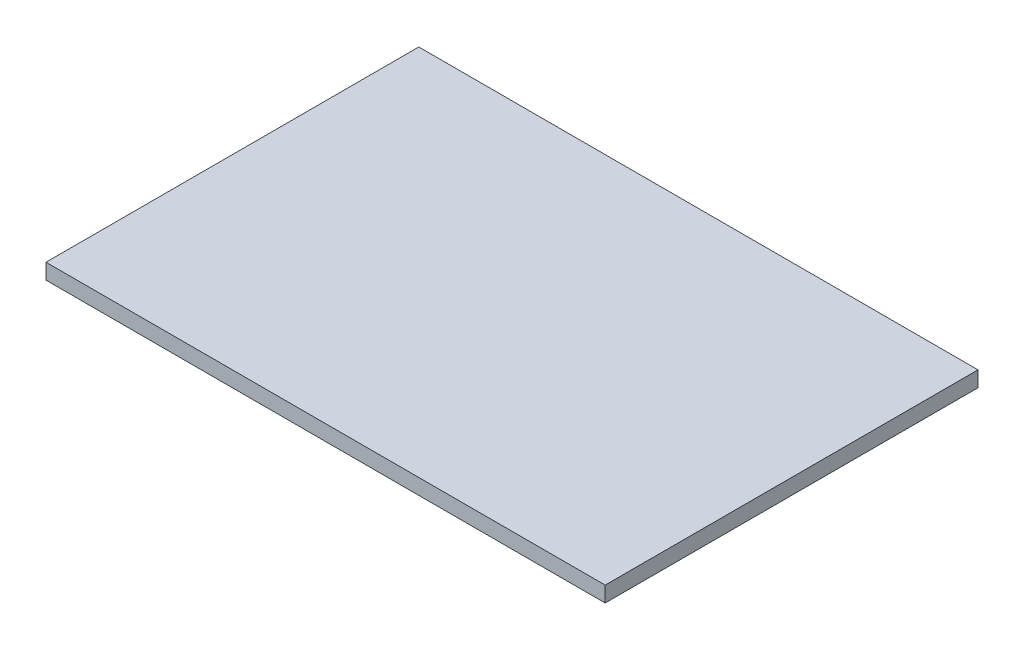
ISO-10303-21;
HEADER;
FILE_DESCRIPTION(('STEP AP214'),'2;1');
FILE_NAME('part.step','',(''),(''),'','','');
FILE_SCHEMA(('AUTOMOTIVE_DESIGN { 1 0 10303 214 1 1 1 1 }'));
ENDSEC;
DATA;
#1=APPLICATION_CONTEXT('core data for automotive mechanical design processes');
#2=APPLICATION_PROTOCOL_DEFINITION('international standard','automotive_design',2000,#1);
#3=PRODUCT_CONTEXT('',#1,'mechanical');
#4=PRODUCT('Part','Part','',(#3));
#5=PRODUCT_RELATED_PRODUCT_CATEGORY('part','',(#4));
#6=PRODUCT_DEFINITION_FORMATION('','',#4);
#7=PRODUCT_DEFINITION_CONTEXT('part definition',#1,'design');
#8=PRODUCT_DEFINITION('design','',#6,#7);
#9=PRODUCT_DEFINITION_SHAPE('','',#8);
#10=(LENGTH_UNIT() NAMED_UNIT(*) SI_UNIT(.MILLI.,.METRE.));
#11=(NAMED_UNIT(*) PLANE_ANGLE_UNIT() SI_UNIT($,.RADIAN.));
#12=(NAMED_UNIT(*) SI_UNIT($,.STERADIAN.) SOLID_ANGLE_UNIT());
#13=UNCERTAINTY_MEASURE_WITH_UNIT(LENGTH_MEASURE(1.E-05),#10,'distance_accuracy_value','');
#14=(GEOMETRIC_REPRESENTATION_CONTEXT(3) GLOBAL_UNCERTAINTY_ASSIGNED_CONTEXT((#13)) GLOBAL_UNIT_ASSIGNED_CONTEXT((#10,
#11,#12)) REPRESENTATION_CONTEXT('',''));
#15=CARTESIAN_POINT('',(0.,0.,0.));
#16=DIRECTION('',(0.,0.,1.));
#17=DIRECTION('',(1.,0.,0.));
#18=AXIS2_PLACEMENT_3D('',#15,#16,#17);
#19=CARTESIAN_POINT('',(90.,5.,60.));
#20=DIRECTION('',(-1.,0.,0.));
#21=DIRECTION('',(0.,0.,1.));
#22=AXIS2_PLACEMENT_3D('',#19,#20,#21);
#23=PLANE('',#22);
#24=DIRECTION('',(0.,0.,-1.));
#25=VECTOR('',#24,1.);
#26=CARTESIAN_POINT('',(90.,0.,60.));
#27=LINE('',#26,#25);
#28=CARTESIAN_POINT('',(90.,0.,60.));
#29=VERTEX_POINT('',#28);
#30=CARTESIAN_POINT('',(90.,0.,-60.));
#31=VERTEX_POINT('',#30);
#32=EDGE_CURVE('E98',#29,#31,#27,.T.);
#33=ORIENTED_EDGE('',*,*,#32,.T.);
#34=DIRECTION('',(0.,-1.,0.));
#35=VECTOR('',#34,1.);
#36=CARTESIAN_POINT('',(90.,5.,-60.));
#37=LINE('',#36,#35);
#38=CARTESIAN_POINT('',(90.,5.,-60.));
#39=VERTEX_POINT('',#38);
#40=EDGE_CURVE('E11',#39,#31,#37,.T.);
#41=ORIENTED_EDGE('',*,*,#40,.F.);
#42=DIRECTION('',(0.,0.,-1.));
#43=VECTOR('',#42,1.);
#44=CARTESIAN_POINT('',(90.,5.,60.));
#45=LINE('',#44,#43);
#46=CARTESIAN_POINT('',(90.,5.,60.));
#47=VERTEX_POINT('',#46);
#48=EDGE_CURVE('E86',#47,#39,#45,.T.);
#49=ORIENTED_EDGE('',*,*,#48,.F.);
#50=DIRECTION('',(0.,-1.,0.));
#51=VECTOR('',#50,1.);
#52=CARTESIAN_POINT('',(90.,5.,60.));
#53=LINE('',#52,#51);
#54=EDGE_CURVE('E94',#47,#29,#53,.T.);
#55=ORIENTED_EDGE('',*,*,#54,.T.);
#56=EDGE_LOOP('',(#33,#41,#49,#55));
#57=FACE_BOUND('',#56,.T.);
#58=ADVANCED_FACE('F35',(#57),#23,.F.);
#59=CARTESIAN_POINT('',(-90.,5.,-60.));
#60=DIRECTION('',(0.,0.,1.));
#61=DIRECTION('',(1.,0.,0.));
#62=AXIS2_PLACEMENT_3D('',#59,#60,#61);
#63=PLANE('',#62);
#64=DIRECTION('',(-1.,0.,0.));
#65=VECTOR('',#64,1.);
#66=CARTESIAN_POINT('',(-90.,0.,-60.));
#67=LINE('',#66,#65);
#68=CARTESIAN_POINT('',(-90.,0.,-60.));
#69=VERTEX_POINT('',#68);
#70=EDGE_CURVE('E90',#31,#69,#67,.T.);
#71=ORIENTED_EDGE('',*,*,#70,.T.);
#72=DIRECTION('',(0.,-1.,0.));
#73=VECTOR('',#72,1.);
#74=CARTESIAN_POINT('',(-90.,5.,-60.));
#75=LINE('',#74,#73);
#76=CARTESIAN_POINT('',(-90.,5.,-60.));
#77=VERTEX_POINT('',#76);
#78=EDGE_CURVE('E43',#77,#69,#75,.T.);
#79=ORIENTED_EDGE('',*,*,#78,.F.);
#80=DIRECTION('',(-1.,0.,0.));
#81=VECTOR('',#80,1.);
#82=CARTESIAN_POINT('',(-90.,5.,-60.));
#83=LINE('',#82,#81);
#84=EDGE_CURVE('E81',#39,#77,#83,.T.);
#85=ORIENTED_EDGE('',*,*,#84,.F.);
#86=ORIENTED_EDGE('',*,*,#40,.T.);
#87=EDGE_LOOP('',(#71,#79,#85,#86));
#88=FACE_BOUND('',#87,.T.);
#89=ADVANCED_FACE('F89',(#88),#63,.F.);
#90=CARTESIAN_POINT('',(-90.,5.,60.));
#91=DIRECTION('',(1.,0.,0.));
#92=DIRECTION('',(0.,0.,-1.));
#93=AXIS2_PLACEMENT_3D('',#90,#91,#92);
#94=PLANE('',#93);
#95=DIRECTION('',(0.,0.,1.));
#96=VECTOR('',#95,1.);
#97=CARTESIAN_POINT('',(-90.,0.,60.));
#98=LINE('',#97,#96);
#99=CARTESIAN_POINT('',(-90.,0.,60.));
#100=VERTEX_POINT('',#99);
#101=EDGE_CURVE('E68',#69,#100,#98,.T.);
#102=ORIENTED_EDGE('',*,*,#101,.T.);
#103=DIRECTION('',(0.,-1.,0.));
#104=VECTOR('',#103,1.);
#105=CARTESIAN_POINT('',(-90.,5.,60.));
#106=LINE('',#105,#104);
#107=CARTESIAN_POINT('',(-90.,5.,60.));
#108=VERTEX_POINT('',#107);
#109=EDGE_CURVE('E91',#108,#100,#106,.T.);
#110=ORIENTED_EDGE('',*,*,#109,.F.);
#111=DIRECTION('',(0.,0.,1.));
#112=VECTOR('',#111,1.);
#113=CARTESIAN_POINT('',(-90.,5.,60.));
#114=LINE('',#113,#112);
#115=EDGE_CURVE('E84',#77,#108,#114,.T.);
#116=ORIENTED_EDGE('',*,*,#115,.F.);
#117=ORIENTED_EDGE('',*,*,#78,.T.);
#118=EDGE_LOOP('',(#102,#110,#116,#117));
#119=FACE_BOUND('',#118,.T.);
#120=ADVANCED_FACE('F92',(#119),#94,.F.);
#121=CARTESIAN_POINT('',(-90.,5.,60.));
#122=DIRECTION('',(0.,0.,-1.));
#123=DIRECTION('',(-1.,0.,0.));
#124=AXIS2_PLACEMENT_3D('',#121,#122,#123);
#125=PLANE('',#124);
#126=DIRECTION('',(1.,0.,0.));
#127=VECTOR('',#126,1.);
#128=CARTESIAN_POINT('',(-90.,0.,60.));
#129=LINE('',#128,#127);
#130=EDGE_CURVE('E74',#100,#29,#129,.T.);
#131=ORIENTED_EDGE('',*,*,#130,.T.);
#132=ORIENTED_EDGE('',*,*,#54,.F.);
#133=DIRECTION('',(1.,0.,0.));
#134=VECTOR('',#133,1.);
#135=CARTESIAN_POINT('',(-90.,5.,60.));
#136=LINE('',#135,#134);
#137=EDGE_CURVE('E51',#108,#47,#136,.T.);
#138=ORIENTED_EDGE('',*,*,#137,.F.);
#139=ORIENTED_EDGE('',*,*,#109,.T.);
#140=EDGE_LOOP('',(#131,#132,#138,#139));
#141=FACE_BOUND('',#140,.T.);
#142=ADVANCED_FACE('F105',(#141),#125,.F.);
#143=CARTESIAN_POINT('',(0.,5.,0.));
#144=DIRECTION('',(0.,-1.,0.));
#145=DIRECTION('',(0.,0.,-1.));
#146=AXIS2_PLACEMENT_3D('',#143,#144,#145);
#147=PLANE('',#146);
#148=ORIENTED_EDGE('',*,*,#48,.T.);
#149=ORIENTED_EDGE('',*,*,#84,.T.);
#150=ORIENTED_EDGE('',*,*,#115,.T.);
#151=ORIENTED_EDGE('',*,*,#137,.T.);
#152=EDGE_LOOP('',(#148,#149,#150,#151));
#153=FACE_BOUND('',#152,.T.);
#154=ADVANCED_FACE('F82',(#153),#147,.F.);
#155=CARTESIAN_POINT('',(0.,0.,0.));
#156=DIRECTION('',(0.,-1.,0.));
#157=DIRECTION('',(0.,0.,-1.));
#158=AXIS2_PLACEMENT_3D('',#155,#156,#157);
#159=PLANE('',#158);
#160=ORIENTED_EDGE('',*,*,#32,.F.);
#161=ORIENTED_EDGE('',*,*,#130,.F.);
#162=ORIENTED_EDGE('',*,*,#101,.F.);
#163=ORIENTED_EDGE('',*,*,#70,.F.);
#164=EDGE_LOOP('',(#160,#161,#162,#163));
#165=FACE_BOUND('',#164,.T.);
#166=ADVANCED_FACE('F108',(#165),#159,.T.);
#167=CLOSED_SHELL('',(#58,#89,#120,#142,#154,#166));
#168=MANIFOLD_SOLID_BREP('B2',#167);
#169=ADVANCED_BREP_SHAPE_REPRESENTATION('',(#18,#168),#14);
#170=SHAPE_DEFINITION_REPRESENTATION(#9,#169);
ENDSEC;
END-ISO-10303-21;
